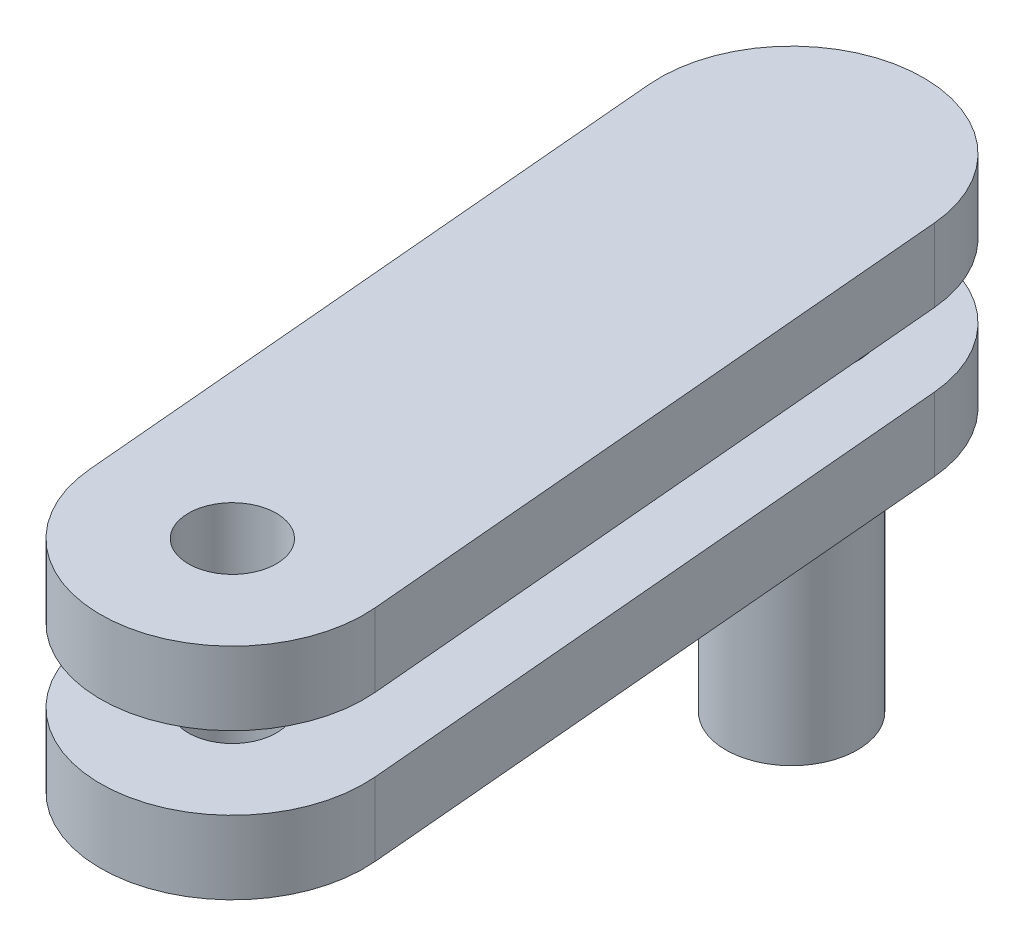
ISO-10303-21;
HEADER;
FILE_DESCRIPTION(('STEP AP214'),'2;1');
FILE_NAME('part.step','',(''),(''),'','','');
FILE_SCHEMA(('AUTOMOTIVE_DESIGN { 1 0 10303 214 1 1 1 1 }'));
ENDSEC;
DATA;
#1=APPLICATION_CONTEXT('core data for automotive mechanical design processes');
#2=APPLICATION_PROTOCOL_DEFINITION('international standard','automotive_design',2000,#1);
#3=PRODUCT_CONTEXT('',#1,'mechanical');
#4=PRODUCT('Part','Part','',(#3));
#5=PRODUCT_RELATED_PRODUCT_CATEGORY('part','',(#4));
#6=PRODUCT_DEFINITION_FORMATION('','',#4);
#7=PRODUCT_DEFINITION_CONTEXT('part definition',#1,'design');
#8=PRODUCT_DEFINITION('design','',#6,#7);
#9=PRODUCT_DEFINITION_SHAPE('','',#8);
#10=(LENGTH_UNIT() NAMED_UNIT(*) SI_UNIT(.MILLI.,.METRE.));
#11=(NAMED_UNIT(*) PLANE_ANGLE_UNIT() SI_UNIT($,.RADIAN.));
#12=(NAMED_UNIT(*) SI_UNIT($,.STERADIAN.) SOLID_ANGLE_UNIT());
#13=UNCERTAINTY_MEASURE_WITH_UNIT(LENGTH_MEASURE(1.E-05),#10,'distance_accuracy_value','');
#14=(GEOMETRIC_REPRESENTATION_CONTEXT(3) GLOBAL_UNCERTAINTY_ASSIGNED_CONTEXT((#13)) GLOBAL_UNIT_ASSIGNED_CONTEXT((#10,
#11,#12)) REPRESENTATION_CONTEXT('',''));
#15=CARTESIAN_POINT('',(0.,0.,0.));
#16=DIRECTION('',(0.,0.,1.));
#17=DIRECTION('',(1.,0.,0.));
#18=AXIS2_PLACEMENT_3D('',#15,#16,#17);
#19=CARTESIAN_POINT('',(416.335578617615,140.,114.955578027008));
#20=DIRECTION('',(0.,-1.,0.));
#21=DIRECTION('',(0.,0.,-1.));
#22=AXIS2_PLACEMENT_3D('',#19,#20,#21);
#23=PLANE('',#22);
#24=CARTESIAN_POINT('',(425.486931606119,140.,219.556021326642));
#25=DIRECTION('',(0.,1.,0.));
#26=DIRECTION('',(1.,0.,0.));
#27=AXIS2_PLACEMENT_3D('',#24,#25,#26);
#28=CIRCLE('',#27,15.);
#29=CARTESIAN_POINT('',(410.486931606119,140.,219.556021326642));
#30=VERTEX_POINT('',#29);
#31=EDGE_CURVE('E121',#30,#30,#28,.T.);
#32=ORIENTED_EDGE('',*,*,#31,.T.);
#33=EDGE_LOOP('',(#32));
#34=FACE_BOUND('',#33,.T.);
#35=CARTESIAN_POINT('',(407.18422562911,140.,10.3551347273749));
#36=DIRECTION('',(0.,1.,0.));
#37=DIRECTION('',(1.,0.,0.));
#38=AXIS2_PLACEMENT_3D('',#35,#36,#37);
#39=CIRCLE('',#38,22.5);
#40=CARTESIAN_POINT('',(384.68422562911,140.,10.3551347273749));
#41=VERTEX_POINT('',#40);
#42=EDGE_CURVE('E227',#41,#41,#39,.T.);
#43=ORIENTED_EDGE('',*,*,#42,.T.);
#44=EDGE_LOOP('',(#43));
#45=FACE_BOUND('',#44,.T.);
#46=CARTESIAN_POINT('',(407.18422562911,140.,10.3551347273749));
#47=DIRECTION('',(0.,-1.,0.));
#48=DIRECTION('',(-0.996194698091745,0.,0.0871557427476624));
#49=AXIS2_PLACEMENT_3D('',#46,#47,#48);
#50=CIRCLE('',#49,45.);
#51=CARTESIAN_POINT('',(362.355464214982,140.,14.2771431510197));
#52=VERTEX_POINT('',#51);
#53=CARTESIAN_POINT('',(452.012987043239,140.,6.4331263037301));
#54=VERTEX_POINT('',#53);
#55=EDGE_CURVE('E28',#52,#54,#50,.T.);
#56=ORIENTED_EDGE('',*,*,#55,.T.);
#57=DIRECTION('',(0.08715574274766,0.,0.996194698091745));
#58=VECTOR('',#57,1.);
#59=CARTESIAN_POINT('',(452.012987043239,140.,6.43312630373037));
#60=LINE('',#59,#58);
#61=CARTESIAN_POINT('',(470.315693020248,140.,215.634012902997));
#62=VERTEX_POINT('',#61);
#63=EDGE_CURVE('E139',#54,#62,#60,.T.);
#64=ORIENTED_EDGE('',*,*,#63,.T.);
#65=CARTESIAN_POINT('',(425.486931606119,140.,219.556021326642));
#66=DIRECTION('',(0.,-1.,0.));
#67=DIRECTION('',(0.996194698091745,0.,-0.0871557427476594));
#68=AXIS2_PLACEMENT_3D('',#65,#66,#67);
#69=CIRCLE('',#68,45.);
#70=CARTESIAN_POINT('',(380.658170191991,140.,223.478029750286));
#71=VERTEX_POINT('',#70);
#72=EDGE_CURVE('E130',#62,#71,#69,.T.);
#73=ORIENTED_EDGE('',*,*,#72,.T.);
#74=DIRECTION('',(-0.08715574274766,0.,-0.996194698091745));
#75=VECTOR('',#74,1.);
#76=CARTESIAN_POINT('',(380.658170191991,140.,223.478029750286));
#77=LINE('',#76,#75);
#78=EDGE_CURVE('E167',#71,#52,#77,.T.);
#79=ORIENTED_EDGE('',*,*,#78,.T.);
#80=EDGE_LOOP('',(#56,#64,#73,#79));
#81=FACE_BOUND('',#80,.T.);
#82=ADVANCED_FACE('F17',(#34,#45,#81),#23,.T.);
#83=CARTESIAN_POINT('',(416.335578617615,165.,114.955578027008));
#84=DIRECTION('',(0.,-1.,0.));
#85=DIRECTION('',(0.,0.,-1.));
#86=AXIS2_PLACEMENT_3D('',#83,#84,#85);
#87=PLANE('',#86);
#88=CARTESIAN_POINT('',(425.486931606119,165.,219.556021326642));
#89=DIRECTION('',(0.,1.,0.));
#90=DIRECTION('',(1.,0.,0.));
#91=AXIS2_PLACEMENT_3D('',#88,#89,#90);
#92=CIRCLE('',#91,15.);
#93=CARTESIAN_POINT('',(410.486931606119,165.,219.556021326642));
#94=VERTEX_POINT('',#93);
#95=EDGE_CURVE('E21',#94,#94,#92,.T.);
#96=ORIENTED_EDGE('',*,*,#95,.F.);
#97=EDGE_LOOP('',(#96));
#98=FACE_BOUND('',#97,.T.);
#99=CARTESIAN_POINT('',(407.18422562911,165.,10.3551347273749));
#100=DIRECTION('',(0.,1.,0.));
#101=DIRECTION('',(1.,0.,0.));
#102=AXIS2_PLACEMENT_3D('',#99,#100,#101);
#103=CIRCLE('',#102,22.5);
#104=CARTESIAN_POINT('',(384.68422562911,165.,10.3551347273749));
#105=VERTEX_POINT('',#104);
#106=EDGE_CURVE('E232',#105,#105,#103,.T.);
#107=ORIENTED_EDGE('',*,*,#106,.F.);
#108=EDGE_LOOP('',(#107));
#109=FACE_BOUND('',#108,.T.);
#110=CARTESIAN_POINT('',(407.18422562911,165.,10.3551347273749));
#111=DIRECTION('',(0.,-1.,0.));
#112=DIRECTION('',(-0.996194698091745,0.,0.0871557427476624));
#113=AXIS2_PLACEMENT_3D('',#110,#111,#112);
#114=CIRCLE('',#113,45.);
#115=CARTESIAN_POINT('',(362.355464214982,165.,14.2771431510197));
#116=VERTEX_POINT('',#115);
#117=CARTESIAN_POINT('',(452.012987043239,165.,6.4331263037301));
#118=VERTEX_POINT('',#117);
#119=EDGE_CURVE('E11',#116,#118,#114,.T.);
#120=ORIENTED_EDGE('',*,*,#119,.F.);
#121=DIRECTION('',(-0.08715574274766,0.,-0.996194698091745));
#122=VECTOR('',#121,1.);
#123=CARTESIAN_POINT('',(380.658170191991,165.,223.478029750286));
#124=LINE('',#123,#122);
#125=CARTESIAN_POINT('',(380.658170191991,165.,223.478029750286));
#126=VERTEX_POINT('',#125);
#127=EDGE_CURVE('E148',#126,#116,#124,.T.);
#128=ORIENTED_EDGE('',*,*,#127,.F.);
#129=CARTESIAN_POINT('',(425.486931606119,165.,219.556021326642));
#130=DIRECTION('',(0.,-1.,0.));
#131=DIRECTION('',(0.996194698091745,0.,-0.0871557427476594));
#132=AXIS2_PLACEMENT_3D('',#129,#130,#131);
#133=CIRCLE('',#132,45.);
#134=CARTESIAN_POINT('',(470.315693020248,165.,215.634012902997));
#135=VERTEX_POINT('',#134);
#136=EDGE_CURVE('E219',#135,#126,#133,.T.);
#137=ORIENTED_EDGE('',*,*,#136,.F.);
#138=DIRECTION('',(0.08715574274766,0.,0.996194698091745));
#139=VECTOR('',#138,1.);
#140=CARTESIAN_POINT('',(452.012987043239,165.,6.43312630373037));
#141=LINE('',#140,#139);
#142=EDGE_CURVE('E150',#118,#135,#141,.T.);
#143=ORIENTED_EDGE('',*,*,#142,.F.);
#144=EDGE_LOOP('',(#120,#128,#137,#143));
#145=FACE_BOUND('',#144,.T.);
#146=ADVANCED_FACE('F145',(#98,#109,#145),#87,.F.);
#147=CARTESIAN_POINT('',(407.18422562911,140.,10.3551347273749));
#148=DIRECTION('',(0.,-1.,0.));
#149=DIRECTION('',(-0.996194698091745,0.,0.0871557427476624));
#150=AXIS2_PLACEMENT_3D('',#147,#148,#149);
#151=CYLINDRICAL_SURFACE('',#150,45.);
#152=ORIENTED_EDGE('',*,*,#55,.F.);
#153=DIRECTION('',(0.,1.,0.));
#154=VECTOR('',#153,1.);
#155=CARTESIAN_POINT('',(362.355464214982,140.,14.2771431510197));
#156=LINE('',#155,#154);
#157=EDGE_CURVE('E153',#52,#116,#156,.T.);
#158=ORIENTED_EDGE('',*,*,#157,.T.);
#159=ORIENTED_EDGE('',*,*,#119,.T.);
#160=DIRECTION('',(0.,1.,0.));
#161=VECTOR('',#160,1.);
#162=CARTESIAN_POINT('',(452.012987043239,140.,6.4331263037301));
#163=LINE('',#162,#161);
#164=EDGE_CURVE('E198',#54,#118,#163,.T.);
#165=ORIENTED_EDGE('',*,*,#164,.F.);
#166=EDGE_LOOP('',(#152,#158,#159,#165));
#167=FACE_BOUND('',#166,.T.);
#168=ADVANCED_FACE('F154',(#167),#151,.T.);
#169=CARTESIAN_POINT('',(452.012987043239,140.,6.43312630373037));
#170=DIRECTION('',(-0.996194698091745,0.,0.08715574274766));
#171=DIRECTION('',(0.,1.,0.));
#172=AXIS2_PLACEMENT_3D('',#169,#170,#171);
#173=PLANE('',#172);
#174=ORIENTED_EDGE('',*,*,#63,.F.);
#175=ORIENTED_EDGE('',*,*,#164,.T.);
#176=ORIENTED_EDGE('',*,*,#142,.T.);
#177=DIRECTION('',(0.,1.,0.));
#178=VECTOR('',#177,1.);
#179=CARTESIAN_POINT('',(470.315693020248,140.,215.634012902997));
#180=LINE('',#179,#178);
#181=EDGE_CURVE('E215',#62,#135,#180,.T.);
#182=ORIENTED_EDGE('',*,*,#181,.F.);
#183=EDGE_LOOP('',(#174,#175,#176,#182));
#184=FACE_BOUND('',#183,.T.);
#185=ADVANCED_FACE('F327',(#184),#173,.F.);
#186=CARTESIAN_POINT('',(425.486931606119,140.,219.556021326642));
#187=DIRECTION('',(0.,-1.,0.));
#188=DIRECTION('',(0.996194698091745,0.,-0.0871557427476594));
#189=AXIS2_PLACEMENT_3D('',#186,#187,#188);
#190=CYLINDRICAL_SURFACE('',#189,45.);
#191=ORIENTED_EDGE('',*,*,#72,.F.);
#192=ORIENTED_EDGE('',*,*,#181,.T.);
#193=ORIENTED_EDGE('',*,*,#136,.T.);
#194=DIRECTION('',(0.,1.,0.));
#195=VECTOR('',#194,1.);
#196=CARTESIAN_POINT('',(380.658170191991,140.,223.478029750286));
#197=LINE('',#196,#195);
#198=EDGE_CURVE('E160',#71,#126,#197,.T.);
#199=ORIENTED_EDGE('',*,*,#198,.F.);
#200=EDGE_LOOP('',(#191,#192,#193,#199));
#201=FACE_BOUND('',#200,.T.);
#202=ADVANCED_FACE('F331',(#201),#190,.T.);
#203=CARTESIAN_POINT('',(380.658170191991,140.,223.478029750286));
#204=DIRECTION('',(0.996194698091745,0.,-0.08715574274766));
#205=DIRECTION('',(0.,-1.,0.));
#206=AXIS2_PLACEMENT_3D('',#203,#204,#205);
#207=PLANE('',#206);
#208=ORIENTED_EDGE('',*,*,#78,.F.);
#209=ORIENTED_EDGE('',*,*,#198,.T.);
#210=ORIENTED_EDGE('',*,*,#127,.T.);
#211=ORIENTED_EDGE('',*,*,#157,.F.);
#212=EDGE_LOOP('',(#208,#209,#210,#211));
#213=FACE_BOUND('',#212,.T.);
#214=ADVANCED_FACE('F159',(#213),#207,.F.);
#215=CARTESIAN_POINT('',(425.486931606119,140.,219.556021326642));
#216=DIRECTION('',(0.,-1.,0.));
#217=DIRECTION('',(1.,0.,0.));
#218=AXIS2_PLACEMENT_3D('',#215,#216,#217);
#219=CYLINDRICAL_SURFACE('',#218,15.);
#220=ORIENTED_EDGE('',*,*,#95,.T.);
#221=DIRECTION('',(0.,-1.,0.));
#222=VECTOR('',#221,1.);
#223=CARTESIAN_POINT('',(410.486931606119,140.,219.556021326642));
#224=LINE('',#223,#222);
#225=EDGE_CURVE('E186',#94,#30,#224,.T.);
#226=ORIENTED_EDGE('',*,*,#225,.T.);
#227=ORIENTED_EDGE('',*,*,#31,.F.);
#228=ORIENTED_EDGE('',*,*,#225,.F.);
#229=EDGE_LOOP('',(#220,#226,#227,#228));
#230=FACE_BOUND('',#229,.T.);
#231=ADVANCED_FACE('F297',(#230),#219,.F.);
#232=CARTESIAN_POINT('',(416.335578617615,190.,114.955578027008));
#233=DIRECTION('',(0.,-1.,0.));
#234=DIRECTION('',(0.,0.,-1.));
#235=AXIS2_PLACEMENT_3D('',#232,#233,#234);
#236=PLANE('',#235);
#237=CARTESIAN_POINT('',(425.486931606119,190.,219.556021326642));
#238=DIRECTION('',(0.,1.,0.));
#239=DIRECTION('',(1.,0.,0.));
#240=AXIS2_PLACEMENT_3D('',#237,#238,#239);
#241=CIRCLE('',#240,15.);
#242=CARTESIAN_POINT('',(410.486931606119,190.,219.556021326642));
#243=VERTEX_POINT('',#242);
#244=EDGE_CURVE('E177',#243,#243,#241,.T.);
#245=ORIENTED_EDGE('',*,*,#244,.T.);
#246=EDGE_LOOP('',(#245));
#247=FACE_BOUND('',#246,.T.);
#248=CARTESIAN_POINT('',(407.18422562911,190.,10.3551347273749));
#249=DIRECTION('',(0.,1.,0.));
#250=DIRECTION('',(1.,0.,0.));
#251=AXIS2_PLACEMENT_3D('',#248,#249,#250);
#252=CIRCLE('',#251,22.5);
#253=CARTESIAN_POINT('',(384.68422562911,190.,10.3551347273749));
#254=VERTEX_POINT('',#253);
#255=EDGE_CURVE('E220',#254,#254,#252,.T.);
#256=ORIENTED_EDGE('',*,*,#255,.T.);
#257=EDGE_LOOP('',(#256));
#258=FACE_BOUND('',#257,.T.);
#259=CARTESIAN_POINT('',(407.18422562911,190.,10.3551347273749));
#260=DIRECTION('',(0.,-1.,0.));
#261=DIRECTION('',(-0.996194698091745,0.,0.0871557427476624));
#262=AXIS2_PLACEMENT_3D('',#259,#260,#261);
#263=CIRCLE('',#262,45.);
#264=CARTESIAN_POINT('',(362.355464214982,190.,14.2771431510197));
#265=VERTEX_POINT('',#264);
#266=CARTESIAN_POINT('',(452.012987043239,190.,6.4331263037301));
#267=VERTEX_POINT('',#266);
#268=EDGE_CURVE('E239',#265,#267,#263,.T.);
#269=ORIENTED_EDGE('',*,*,#268,.T.);
#270=DIRECTION('',(0.08715574274766,0.,0.996194698091745));
#271=VECTOR('',#270,1.);
#272=CARTESIAN_POINT('',(452.012987043239,190.,6.43312630373037));
#273=LINE('',#272,#271);
#274=CARTESIAN_POINT('',(470.315693020248,190.,215.634012902997));
#275=VERTEX_POINT('',#274);
#276=EDGE_CURVE('E184',#267,#275,#273,.T.);
#277=ORIENTED_EDGE('',*,*,#276,.T.);
#278=CARTESIAN_POINT('',(425.486931606119,190.,219.556021326642));
#279=DIRECTION('',(0.,-1.,0.));
#280=DIRECTION('',(0.996194698091745,0.,-0.0871557427476594));
#281=AXIS2_PLACEMENT_3D('',#278,#279,#280);
#282=CIRCLE('',#281,45.);
#283=CARTESIAN_POINT('',(380.658170191991,190.,223.478029750286));
#284=VERTEX_POINT('',#283);
#285=EDGE_CURVE('E196',#275,#284,#282,.T.);
#286=ORIENTED_EDGE('',*,*,#285,.T.);
#287=DIRECTION('',(-0.08715574274766,0.,-0.996194698091745));
#288=VECTOR('',#287,1.);
#289=CARTESIAN_POINT('',(380.658170191991,190.,223.478029750286));
#290=LINE('',#289,#288);
#291=EDGE_CURVE('E173',#284,#265,#290,.T.);
#292=ORIENTED_EDGE('',*,*,#291,.T.);
#293=EDGE_LOOP('',(#269,#277,#286,#292));
#294=FACE_BOUND('',#293,.T.);
#295=ADVANCED_FACE('F273',(#247,#258,#294),#236,.T.);
#296=CARTESIAN_POINT('',(416.335578617615,215.,114.955578027008));
#297=DIRECTION('',(0.,-1.,0.));
#298=DIRECTION('',(0.,0.,-1.));
#299=AXIS2_PLACEMENT_3D('',#296,#297,#298);
#300=PLANE('',#299);
#301=CARTESIAN_POINT('',(425.486931606119,215.,219.556021326642));
#302=DIRECTION('',(0.,1.,0.));
#303=DIRECTION('',(1.,0.,0.));
#304=AXIS2_PLACEMENT_3D('',#301,#302,#303);
#305=CIRCLE('',#304,15.);
#306=CARTESIAN_POINT('',(410.486931606119,215.,219.556021326642));
#307=VERTEX_POINT('',#306);
#308=EDGE_CURVE('E204',#307,#307,#305,.T.);
#309=ORIENTED_EDGE('',*,*,#308,.F.);
#310=EDGE_LOOP('',(#309));
#311=FACE_BOUND('',#310,.T.);
#312=CARTESIAN_POINT('',(407.18422562911,215.,10.3551347273749));
#313=DIRECTION('',(0.,-1.,0.));
#314=DIRECTION('',(-0.996194698091745,0.,0.0871557427476624));
#315=AXIS2_PLACEMENT_3D('',#312,#313,#314);
#316=CIRCLE('',#315,45.);
#317=CARTESIAN_POINT('',(362.355464214982,215.,14.2771431510197));
#318=VERTEX_POINT('',#317);
#319=CARTESIAN_POINT('',(452.012987043239,215.,6.4331263037301));
#320=VERTEX_POINT('',#319);
#321=EDGE_CURVE('E171',#318,#320,#316,.T.);
#322=ORIENTED_EDGE('',*,*,#321,.F.);
#323=DIRECTION('',(-0.08715574274766,0.,-0.996194698091745));
#324=VECTOR('',#323,1.);
#325=CARTESIAN_POINT('',(380.658170191991,215.,223.478029750286));
#326=LINE('',#325,#324);
#327=CARTESIAN_POINT('',(380.658170191991,215.,223.478029750286));
#328=VERTEX_POINT('',#327);
#329=EDGE_CURVE('E197',#328,#318,#326,.T.);
#330=ORIENTED_EDGE('',*,*,#329,.F.);
#331=CARTESIAN_POINT('',(425.486931606119,215.,219.556021326642));
#332=DIRECTION('',(0.,-1.,0.));
#333=DIRECTION('',(0.996194698091745,0.,-0.0871557427476594));
#334=AXIS2_PLACEMENT_3D('',#331,#332,#333);
#335=CIRCLE('',#334,45.);
#336=CARTESIAN_POINT('',(470.315693020248,215.,215.634012902997));
#337=VERTEX_POINT('',#336);
#338=EDGE_CURVE('E180',#337,#328,#335,.T.);
#339=ORIENTED_EDGE('',*,*,#338,.F.);
#340=DIRECTION('',(0.08715574274766,0.,0.996194698091745));
#341=VECTOR('',#340,1.);
#342=CARTESIAN_POINT('',(452.012987043239,215.,6.43312630373037));
#343=LINE('',#342,#341);
#344=EDGE_CURVE('E235',#320,#337,#343,.T.);
#345=ORIENTED_EDGE('',*,*,#344,.F.);
#346=EDGE_LOOP('',(#322,#330,#339,#345));
#347=FACE_BOUND('',#346,.T.);
#348=ADVANCED_FACE('F287',(#311,#347),#300,.F.);
#349=CARTESIAN_POINT('',(407.18422562911,190.,10.3551347273749));
#350=DIRECTION('',(0.,-1.,0.));
#351=DIRECTION('',(-0.996194698091745,0.,0.0871557427476624));
#352=AXIS2_PLACEMENT_3D('',#349,#350,#351);
#353=CYLINDRICAL_SURFACE('',#352,45.);
#354=ORIENTED_EDGE('',*,*,#268,.F.);
#355=DIRECTION('',(0.,1.,0.));
#356=VECTOR('',#355,1.);
#357=CARTESIAN_POINT('',(362.355464214982,190.,14.2771431510197));
#358=LINE('',#357,#356);
#359=EDGE_CURVE('E192',#265,#318,#358,.T.);
#360=ORIENTED_EDGE('',*,*,#359,.T.);
#361=ORIENTED_EDGE('',*,*,#321,.T.);
#362=DIRECTION('',(0.,1.,0.));
#363=VECTOR('',#362,1.);
#364=CARTESIAN_POINT('',(452.012987043239,190.,6.4331263037301));
#365=LINE('',#364,#363);
#366=EDGE_CURVE('E203',#267,#320,#365,.T.);
#367=ORIENTED_EDGE('',*,*,#366,.F.);
#368=EDGE_LOOP('',(#354,#360,#361,#367));
#369=FACE_BOUND('',#368,.T.);
#370=ADVANCED_FACE('F281',(#369),#353,.T.);
#371=CARTESIAN_POINT('',(452.012987043239,190.,6.43312630373037));
#372=DIRECTION('',(-0.996194698091745,0.,0.08715574274766));
#373=DIRECTION('',(0.,1.,0.));
#374=AXIS2_PLACEMENT_3D('',#371,#372,#373);
#375=PLANE('',#374);
#376=ORIENTED_EDGE('',*,*,#276,.F.);
#377=ORIENTED_EDGE('',*,*,#366,.T.);
#378=ORIENTED_EDGE('',*,*,#344,.T.);
#379=DIRECTION('',(0.,1.,0.));
#380=VECTOR('',#379,1.);
#381=CARTESIAN_POINT('',(470.315693020248,190.,215.634012902997));
#382=LINE('',#381,#380);
#383=EDGE_CURVE('E185',#275,#337,#382,.T.);
#384=ORIENTED_EDGE('',*,*,#383,.F.);
#385=EDGE_LOOP('',(#376,#377,#378,#384));
#386=FACE_BOUND('',#385,.T.);
#387=ADVANCED_FACE('F285',(#386),#375,.F.);
#388=CARTESIAN_POINT('',(425.486931606119,190.,219.556021326642));
#389=DIRECTION('',(0.,-1.,0.));
#390=DIRECTION('',(0.996194698091745,0.,-0.0871557427476594));
#391=AXIS2_PLACEMENT_3D('',#388,#389,#390);
#392=CYLINDRICAL_SURFACE('',#391,45.);
#393=ORIENTED_EDGE('',*,*,#285,.F.);
#394=ORIENTED_EDGE('',*,*,#383,.T.);
#395=ORIENTED_EDGE('',*,*,#338,.T.);
#396=DIRECTION('',(0.,1.,0.));
#397=VECTOR('',#396,1.);
#398=CARTESIAN_POINT('',(380.658170191991,190.,223.478029750286));
#399=LINE('',#398,#397);
#400=EDGE_CURVE('E176',#284,#328,#399,.T.);
#401=ORIENTED_EDGE('',*,*,#400,.F.);
#402=EDGE_LOOP('',(#393,#394,#395,#401));
#403=FACE_BOUND('',#402,.T.);
#404=ADVANCED_FACE('F277',(#403),#392,.T.);
#405=CARTESIAN_POINT('',(380.658170191991,190.,223.478029750286));
#406=DIRECTION('',(0.996194698091745,0.,-0.08715574274766));
#407=DIRECTION('',(0.,-1.,0.));
#408=AXIS2_PLACEMENT_3D('',#405,#406,#407);
#409=PLANE('',#408);
#410=ORIENTED_EDGE('',*,*,#291,.F.);
#411=ORIENTED_EDGE('',*,*,#400,.T.);
#412=ORIENTED_EDGE('',*,*,#329,.T.);
#413=ORIENTED_EDGE('',*,*,#359,.F.);
#414=EDGE_LOOP('',(#410,#411,#412,#413));
#415=FACE_BOUND('',#414,.T.);
#416=ADVANCED_FACE('F279',(#415),#409,.F.);
#417=CARTESIAN_POINT('',(425.486931606119,190.,219.556021326642));
#418=DIRECTION('',(0.,-1.,0.));
#419=DIRECTION('',(1.,0.,0.));
#420=AXIS2_PLACEMENT_3D('',#417,#418,#419);
#421=CYLINDRICAL_SURFACE('',#420,15.);
#422=ORIENTED_EDGE('',*,*,#308,.T.);
#423=DIRECTION('',(0.,-1.,0.));
#424=VECTOR('',#423,1.);
#425=CARTESIAN_POINT('',(410.486931606119,190.,219.556021326642));
#426=LINE('',#425,#424);
#427=EDGE_CURVE('E208',#307,#243,#426,.T.);
#428=ORIENTED_EDGE('',*,*,#427,.T.);
#429=ORIENTED_EDGE('',*,*,#244,.F.);
#430=ORIENTED_EDGE('',*,*,#427,.F.);
#431=EDGE_LOOP('',(#422,#428,#429,#430));
#432=FACE_BOUND('',#431,.T.);
#433=ADVANCED_FACE('F19',(#432),#421,.F.);
#434=CARTESIAN_POINT('',(407.18422562911,50.,10.3551347273749));
#435=DIRECTION('',(0.,1.,0.));
#436=DIRECTION('',(1.,0.,0.));
#437=AXIS2_PLACEMENT_3D('',#434,#435,#436);
#438=PLANE('',#437);
#439=CARTESIAN_POINT('',(407.18422562911,50.,10.3551347273749));
#440=DIRECTION('',(0.,-1.,0.));
#441=DIRECTION('',(1.,0.,0.));
#442=AXIS2_PLACEMENT_3D('',#439,#440,#441);
#443=CIRCLE('',#442,22.5);
#444=CARTESIAN_POINT('',(384.68422562911,50.,10.3551347273749));
#445=VERTEX_POINT('',#444);
#446=EDGE_CURVE('E209',#445,#445,#443,.T.);
#447=ORIENTED_EDGE('',*,*,#446,.T.);
#448=EDGE_LOOP('',(#447));
#449=FACE_BOUND('',#448,.T.);
#450=ADVANCED_FACE('F343',(#449),#438,.F.);
#451=CARTESIAN_POINT('',(407.18422562911,50.,10.3551347273749));
#452=DIRECTION('',(0.,-1.,0.));
#453=DIRECTION('',(1.,0.,0.));
#454=AXIS2_PLACEMENT_3D('',#451,#452,#453);
#455=CYLINDRICAL_SURFACE('',#454,22.5);
#456=ORIENTED_EDGE('',*,*,#42,.F.);
#457=DIRECTION('',(0.,-1.,0.));
#458=VECTOR('',#457,1.);
#459=CARTESIAN_POINT('',(384.68422562911,50.,10.3551347273749));
#460=LINE('',#459,#458);
#461=EDGE_CURVE('E231',#41,#445,#460,.T.);
#462=ORIENTED_EDGE('',*,*,#461,.T.);
#463=ORIENTED_EDGE('',*,*,#446,.F.);
#464=ORIENTED_EDGE('',*,*,#461,.F.);
#465=EDGE_LOOP('',(#456,#462,#463,#464));
#466=FACE_BOUND('',#465,.T.);
#467=ADVANCED_FACE('F341',(#466),#455,.T.);
#468=CARTESIAN_POINT('',(407.18422562911,50.,10.3551347273749));
#469=DIRECTION('',(0.,-1.,0.));
#470=DIRECTION('',(1.,0.,0.));
#471=AXIS2_PLACEMENT_3D('',#468,#469,#470);
#472=CYLINDRICAL_SURFACE('',#471,22.5);
#473=ORIENTED_EDGE('',*,*,#255,.F.);
#474=DIRECTION('',(0.,-1.,0.));
#475=VECTOR('',#474,1.);
#476=CARTESIAN_POINT('',(384.68422562911,50.,10.3551347273749));
#477=LINE('',#476,#475);
#478=EDGE_CURVE('E224',#254,#105,#477,.T.);
#479=ORIENTED_EDGE('',*,*,#478,.T.);
#480=ORIENTED_EDGE('',*,*,#106,.T.);
#481=ORIENTED_EDGE('',*,*,#478,.F.);
#482=EDGE_LOOP('',(#473,#479,#480,#481));
#483=FACE_BOUND('',#482,.T.);
#484=ADVANCED_FACE('F305',(#483),#472,.T.);
#485=CLOSED_SHELL('',(#82,#146,#168,#185,#202,#214,#231,#295,#348,#370,#387,#404,#416,#433,#450,
#467,#484));
#486=MANIFOLD_SOLID_BREP('B1',#485);
#487=ADVANCED_BREP_SHAPE_REPRESENTATION('',(#18,#486),#14);
#488=SHAPE_DEFINITION_REPRESENTATION(#9,#487);
ENDSEC;
END-ISO-10303-21;
